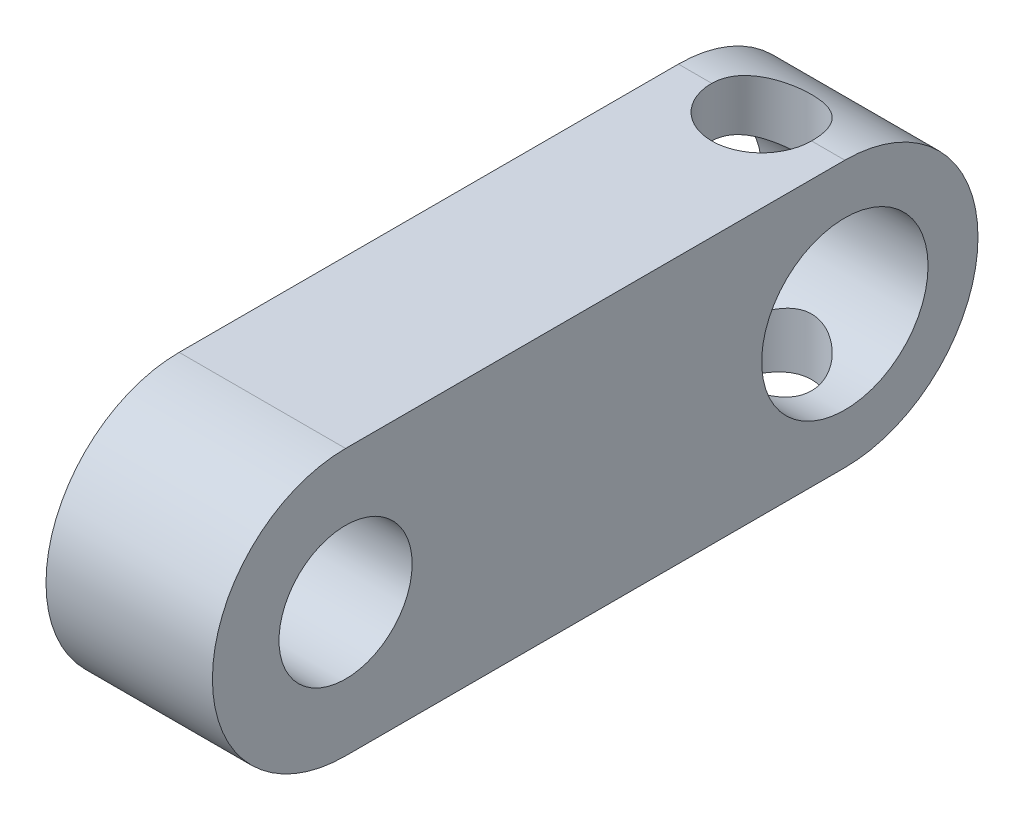
ISO-10303-21;
HEADER;
FILE_DESCRIPTION(('STEP AP214'),'2;1');
FILE_NAME('part.step','',(''),(''),'','','');
FILE_SCHEMA(('AUTOMOTIVE_DESIGN { 1 0 10303 214 1 1 1 1 }'));
ENDSEC;
DATA;
#1=APPLICATION_CONTEXT('core data for automotive mechanical design processes');
#2=APPLICATION_PROTOCOL_DEFINITION('international standard','automotive_design',2000,#1);
#3=PRODUCT_CONTEXT('',#1,'mechanical');
#4=PRODUCT('Part','Part','',(#3));
#5=PRODUCT_RELATED_PRODUCT_CATEGORY('part','',(#4));
#6=PRODUCT_DEFINITION_FORMATION('','',#4);
#7=PRODUCT_DEFINITION_CONTEXT('part definition',#1,'design');
#8=PRODUCT_DEFINITION('design','',#6,#7);
#9=PRODUCT_DEFINITION_SHAPE('','',#8);
#10=(LENGTH_UNIT() NAMED_UNIT(*) SI_UNIT(.MILLI.,.METRE.));
#11=(NAMED_UNIT(*) PLANE_ANGLE_UNIT() SI_UNIT($,.RADIAN.));
#12=(NAMED_UNIT(*) SI_UNIT($,.STERADIAN.) SOLID_ANGLE_UNIT());
#13=UNCERTAINTY_MEASURE_WITH_UNIT(LENGTH_MEASURE(1.E-05),#10,'distance_accuracy_value','');
#14=(GEOMETRIC_REPRESENTATION_CONTEXT(3) GLOBAL_UNCERTAINTY_ASSIGNED_CONTEXT((#13)) GLOBAL_UNIT_ASSIGNED_CONTEXT((#10,
#11,#12)) REPRESENTATION_CONTEXT('',''));
#15=CARTESIAN_POINT('',(0.,0.,0.));
#16=DIRECTION('',(0.,0.,1.));
#17=DIRECTION('',(1.,0.,0.));
#18=AXIS2_PLACEMENT_3D('',#15,#16,#17);
#19=CARTESIAN_POINT('',(10.,0.,15.));
#20=DIRECTION('',(1.,0.,0.));
#21=DIRECTION('',(0.,0.,-1.));
#22=AXIS2_PLACEMENT_3D('',#19,#20,#21);
#23=PLANE('',#22);
#24=CARTESIAN_POINT('',(10.,0.,-15.));
#25=DIRECTION('',(1.,0.,0.));
#26=DIRECTION('',(0.,0.,-1.));
#27=AXIS2_PLACEMENT_3D('',#24,#25,#26);
#28=CIRCLE('',#27,5.);
#29=CARTESIAN_POINT('',(10.,0.,-20.));
#30=VERTEX_POINT('',#29);
#31=EDGE_CURVE('E160',#30,#30,#28,.T.);
#32=ORIENTED_EDGE('',*,*,#31,.F.);
#33=EDGE_LOOP('',(#32));
#34=FACE_BOUND('',#33,.T.);
#35=CARTESIAN_POINT('',(10.,0.,15.));
#36=DIRECTION('',(1.,0.,0.));
#37=DIRECTION('',(0.,0.,-1.));
#38=AXIS2_PLACEMENT_3D('',#35,#36,#37);
#39=CIRCLE('',#38,8.);
#40=CARTESIAN_POINT('',(10.,8.,15.));
#41=VERTEX_POINT('',#40);
#42=CARTESIAN_POINT('',(10.,-8.,15.));
#43=VERTEX_POINT('',#42);
#44=EDGE_CURVE('E164',#41,#43,#39,.T.);
#45=ORIENTED_EDGE('',*,*,#44,.T.);
#46=DIRECTION('',(0.,0.,-1.));
#47=VECTOR('',#46,1.);
#48=CARTESIAN_POINT('',(10.,-8.,15.));
#49=LINE('',#48,#47);
#50=CARTESIAN_POINT('',(10.,-8.,-15.));
#51=VERTEX_POINT('',#50);
#52=EDGE_CURVE('E179',#43,#51,#49,.T.);
#53=ORIENTED_EDGE('',*,*,#52,.T.);
#54=CARTESIAN_POINT('',(10.,0.,-15.));
#55=DIRECTION('',(1.,0.,0.));
#56=DIRECTION('',(0.,0.,1.));
#57=AXIS2_PLACEMENT_3D('',#54,#55,#56);
#58=CIRCLE('',#57,8.);
#59=CARTESIAN_POINT('',(10.,8.,-15.));
#60=VERTEX_POINT('',#59);
#61=EDGE_CURVE('E109',#51,#60,#58,.T.);
#62=ORIENTED_EDGE('',*,*,#61,.T.);
#63=DIRECTION('',(0.,0.,1.));
#64=VECTOR('',#63,1.);
#65=CARTESIAN_POINT('',(10.,8.,-15.));
#66=LINE('',#65,#64);
#67=EDGE_CURVE('E183',#60,#41,#66,.T.);
#68=ORIENTED_EDGE('',*,*,#67,.T.);
#69=EDGE_LOOP('',(#45,#53,#62,#68));
#70=FACE_BOUND('',#69,.T.);
#71=CARTESIAN_POINT('',(10.,0.,15.));
#72=DIRECTION('',(1.,0.,0.));
#73=DIRECTION('',(0.,0.,-1.));
#74=AXIS2_PLACEMENT_3D('',#71,#72,#73);
#75=CIRCLE('',#74,4.);
#76=CARTESIAN_POINT('',(10.,0.,11.));
#77=VERTEX_POINT('',#76);
#78=EDGE_CURVE('E168',#77,#77,#75,.T.);
#79=ORIENTED_EDGE('',*,*,#78,.F.);
#80=EDGE_LOOP('',(#79));
#81=FACE_BOUND('',#80,.T.);
#82=ADVANCED_FACE('F35',(#34,#70,#81),#23,.T.);
#83=CARTESIAN_POINT('',(0.,0.,15.));
#84=DIRECTION('',(1.,0.,0.));
#85=DIRECTION('',(0.,0.,-1.));
#86=AXIS2_PLACEMENT_3D('',#83,#84,#85);
#87=PLANE('',#86);
#88=CARTESIAN_POINT('',(0.,0.,-15.));
#89=DIRECTION('',(1.,0.,0.));
#90=DIRECTION('',(0.,0.,-1.));
#91=AXIS2_PLACEMENT_3D('',#88,#89,#90);
#92=CIRCLE('',#91,5.);
#93=CARTESIAN_POINT('',(0.,0.,-20.));
#94=VERTEX_POINT('',#93);
#95=EDGE_CURVE('E170',#94,#94,#92,.T.);
#96=ORIENTED_EDGE('',*,*,#95,.T.);
#97=EDGE_LOOP('',(#96));
#98=FACE_BOUND('',#97,.T.);
#99=CARTESIAN_POINT('',(0.,0.,15.));
#100=DIRECTION('',(1.,0.,0.));
#101=DIRECTION('',(0.,0.,-1.));
#102=AXIS2_PLACEMENT_3D('',#99,#100,#101);
#103=CIRCLE('',#102,8.);
#104=CARTESIAN_POINT('',(0.,8.,15.));
#105=VERTEX_POINT('',#104);
#106=CARTESIAN_POINT('',(0.,-8.,15.));
#107=VERTEX_POINT('',#106);
#108=EDGE_CURVE('E176',#105,#107,#103,.T.);
#109=ORIENTED_EDGE('',*,*,#108,.F.);
#110=DIRECTION('',(0.,0.,1.));
#111=VECTOR('',#110,1.);
#112=CARTESIAN_POINT('',(0.,8.,-15.));
#113=LINE('',#112,#111);
#114=CARTESIAN_POINT('',(0.,8.,-15.));
#115=VERTEX_POINT('',#114);
#116=EDGE_CURVE('E180',#115,#105,#113,.T.);
#117=ORIENTED_EDGE('',*,*,#116,.F.);
#118=CARTESIAN_POINT('',(0.,0.,-15.));
#119=DIRECTION('',(1.,0.,0.));
#120=DIRECTION('',(0.,0.,1.));
#121=AXIS2_PLACEMENT_3D('',#118,#119,#120);
#122=CIRCLE('',#121,8.);
#123=CARTESIAN_POINT('',(0.,-8.,-15.));
#124=VERTEX_POINT('',#123);
#125=EDGE_CURVE('E190',#124,#115,#122,.T.);
#126=ORIENTED_EDGE('',*,*,#125,.F.);
#127=DIRECTION('',(0.,0.,-1.));
#128=VECTOR('',#127,1.);
#129=CARTESIAN_POINT('',(0.,-8.,15.));
#130=LINE('',#129,#128);
#131=EDGE_CURVE('E188',#107,#124,#130,.T.);
#132=ORIENTED_EDGE('',*,*,#131,.F.);
#133=EDGE_LOOP('',(#109,#117,#126,#132));
#134=FACE_BOUND('',#133,.T.);
#135=CARTESIAN_POINT('',(0.,0.,15.));
#136=DIRECTION('',(1.,0.,0.));
#137=DIRECTION('',(0.,0.,-1.));
#138=AXIS2_PLACEMENT_3D('',#135,#136,#137);
#139=CIRCLE('',#138,4.);
#140=CARTESIAN_POINT('',(0.,0.,11.));
#141=VERTEX_POINT('',#140);
#142=EDGE_CURVE('E96',#141,#141,#139,.T.);
#143=ORIENTED_EDGE('',*,*,#142,.T.);
#144=EDGE_LOOP('',(#143));
#145=FACE_BOUND('',#144,.T.);
#146=ADVANCED_FACE('F149',(#98,#134,#145),#87,.F.);
#147=CARTESIAN_POINT('',(10.,0.,15.));
#148=DIRECTION('',(-1.,0.,0.));
#149=DIRECTION('',(0.,0.,1.));
#150=AXIS2_PLACEMENT_3D('',#147,#148,#149);
#151=CYLINDRICAL_SURFACE('',#150,8.);
#152=ORIENTED_EDGE('',*,*,#108,.T.);
#153=DIRECTION('',(-1.,0.,0.));
#154=VECTOR('',#153,1.);
#155=CARTESIAN_POINT('',(10.,-8.,15.));
#156=LINE('',#155,#154);
#157=EDGE_CURVE('E11',#43,#107,#156,.T.);
#158=ORIENTED_EDGE('',*,*,#157,.F.);
#159=ORIENTED_EDGE('',*,*,#44,.F.);
#160=DIRECTION('',(-1.,0.,0.));
#161=VECTOR('',#160,1.);
#162=CARTESIAN_POINT('',(10.,8.,15.));
#163=LINE('',#162,#161);
#164=EDGE_CURVE('E185',#41,#105,#163,.T.);
#165=ORIENTED_EDGE('',*,*,#164,.T.);
#166=EDGE_LOOP('',(#152,#158,#159,#165));
#167=FACE_BOUND('',#166,.T.);
#168=ADVANCED_FACE('F37',(#167),#151,.T.);
#169=CARTESIAN_POINT('',(10.,-8.,15.));
#170=DIRECTION('',(0.,1.,0.));
#171=DIRECTION('',(0.,0.,1.));
#172=AXIS2_PLACEMENT_3D('',#169,#170,#171);
#173=PLANE('',#172);
#174=DIRECTION('',(-1.,0.,0.));
#175=VECTOR('',#174,1.);
#176=CARTESIAN_POINT('',(10.,-8.,-15.));
#177=LINE('',#176,#175);
#178=CARTESIAN_POINT('',(2.,-8.,-15.));
#179=VERTEX_POINT('',#178);
#180=EDGE_CURVE('E103',#179,#124,#177,.T.);
#181=ORIENTED_EDGE('',*,*,#180,.F.);
#182=CARTESIAN_POINT('',(5.,-8.,-15.));
#183=DIRECTION('',(0.,1.,0.));
#184=DIRECTION('',(0.,0.,1.));
#185=AXIS2_PLACEMENT_3D('',#182,#183,#184);
#186=CIRCLE('',#185,3.);
#187=CARTESIAN_POINT('',(8.,-8.,-15.));
#188=VERTEX_POINT('',#187);
#189=EDGE_CURVE('E55',#179,#188,#186,.T.);
#190=ORIENTED_EDGE('',*,*,#189,.T.);
#191=EDGE_CURVE('E48',#51,#188,#177,.T.);
#192=ORIENTED_EDGE('',*,*,#191,.F.);
#193=ORIENTED_EDGE('',*,*,#52,.F.);
#194=ORIENTED_EDGE('',*,*,#157,.T.);
#195=ORIENTED_EDGE('',*,*,#131,.T.);
#196=EDGE_LOOP('',(#181,#190,#192,#193,#194,#195));
#197=FACE_BOUND('',#196,.T.);
#198=ADVANCED_FACE('F100',(#197),#173,.F.);
#199=CARTESIAN_POINT('',(10.,0.,-15.));
#200=DIRECTION('',(-1.,0.,0.));
#201=DIRECTION('',(0.,0.,1.));
#202=AXIS2_PLACEMENT_3D('',#199,#200,#201);
#203=CYLINDRICAL_SURFACE('',#202,8.);
#204=ORIENTED_EDGE('',*,*,#191,.T.);
#205=CARTESIAN_POINT('',(8.,-8.,-15.));
#206=CARTESIAN_POINT('',(8.00001103003993,-8.00001151251917,-15.0813659418454));
#207=CARTESIAN_POINT('',(7.99669003614445,-7.99875895185085,-15.1627247162868));
#208=CARTESIAN_POINT('',(7.9834696649154,-7.99381151281105,-15.3248098564286));
#209=CARTESIAN_POINT('',(7.97357206793986,-7.99011729542405,-15.4055363873017));
#210=CARTESIAN_POINT('',(7.94732554873685,-7.98038766186784,-15.5655307975301));
#211=CARTESIAN_POINT('',(7.93099708377701,-7.97435967070118,-15.6448024760788));
#212=CARTESIAN_POINT('',(7.89206134761697,-7.96013151966453,-15.8015690201844));
#213=CARTESIAN_POINT('',(7.86945385815921,-7.95193128428827,-15.8790638238761));
#214=CARTESIAN_POINT('',(7.79252455835016,-7.92438404820679,-16.1079958005286));
#215=CARTESIAN_POINT('',(7.72905623759329,-7.90207507148888,-16.2561192480531));
#216=CARTESIAN_POINT('',(7.5798134067169,-7.85178467556054,-16.5395744370144));
#217=CARTESIAN_POINT('',(7.49402466260416,-7.82379963918051,-16.6748979404166));
#218=CARTESIAN_POINT('',(7.29877763022069,-7.76372558112298,-16.9346839961627));
#219=CARTESIAN_POINT('',(7.18854238032334,-7.73152085735817,-17.0585367000131));
#220=CARTESIAN_POINT('',(6.94918161687568,-7.66720506105773,-17.2864880565605));
#221=CARTESIAN_POINT('',(6.8200499199968,-7.63509402269942,-17.3905802174668));
#222=CARTESIAN_POINT('',(6.54056256150986,-7.57324885518661,-17.5799652623967));
#223=CARTESIAN_POINT('',(6.38958572937022,-7.54365189318829,-17.6643908248288));
#224=CARTESIAN_POINT('',(6.0742972030408,-7.49199638303748,-17.8063752020465));
#225=CARTESIAN_POINT('',(5.9099913601437,-7.46993454896922,-17.8639457317812));
#226=CARTESIAN_POINT('',(5.57976811518296,-7.43708841602121,-17.9481681764943));
#227=CARTESIAN_POINT('',(5.41419317445154,-7.42587870534969,-17.9759913072979));
#228=CARTESIAN_POINT('',(5.08037098288525,-7.41476122924514,-18.0035911458453));
#229=CARTESIAN_POINT('',(4.91212480958814,-7.41484901683932,-18.0033788890054));
#230=CARTESIAN_POINT('',(4.58845983579158,-7.42595027101939,-17.9758084846518));
#231=CARTESIAN_POINT('',(4.43287597491728,-7.43630952678155,-17.9500757652864));
#232=CARTESIAN_POINT('',(4.12842359873992,-7.46569902811917,-17.8748826968723));
#233=CARTESIAN_POINT('',(3.97955600297058,-7.48473045707913,-17.8254191095161));
#234=CARTESIAN_POINT('',(3.68944607498966,-7.52971401264463,-17.7032749271152));
#235=CARTESIAN_POINT('',(3.54840136882227,-7.55579029731672,-17.6301726655972));
#236=CARTESIAN_POINT('',(3.28010907198272,-7.61188407963322,-17.4631223376586));
#237=CARTESIAN_POINT('',(3.15286631345944,-7.64190294952165,-17.369167005291));
#238=CARTESIAN_POINT('',(2.9068006702968,-7.70495869393669,-17.1556407937871));
#239=CARTESIAN_POINT('',(2.78911653249784,-7.73806288463494,-17.0347736910856));
#240=CARTESIAN_POINT('',(2.57533896161741,-7.80183006456215,-16.7746524008373));
#241=CARTESIAN_POINT('',(2.47925174382808,-7.83249234940967,-16.6353929384849));
#242=CARTESIAN_POINT('',(2.31008615572179,-7.88854441274737,-16.3393348511528));
#243=CARTESIAN_POINT('',(2.23739890296607,-7.91384237052322,-16.1822920644346));
#244=CARTESIAN_POINT('',(2.1493020404674,-7.94517154509492,-15.9386214715073));
#245=CARTESIAN_POINT('',(2.12342748982051,-7.95451083382182,-15.8560584895259));
#246=CARTESIAN_POINT('',(2.0788624928564,-7.9707345786836,-15.6887905536117));
#247=CARTESIAN_POINT('',(2.06016894580771,-7.97762009425579,-15.6040865410457));
#248=CARTESIAN_POINT('',(2.03016506570909,-7.98872426130019,-15.4331443421316));
#249=CARTESIAN_POINT('',(2.01886042745939,-7.99294085569516,-15.3469050249479));
#250=CARTESIAN_POINT('',(2.00377499307039,-7.99858462583634,-15.1737797585207));
#251=CARTESIAN_POINT('',(1.99998571103467,-8.00001494764447,-15.0868946499097));
#252=CARTESIAN_POINT('',(2.,-8.,-15.));
#253=B_SPLINE_CURVE_WITH_KNOTS('',3,(#205,#206,#207,#208,#209,#210,#211,#212,#213,#214,#215,
#216,#217,#218,#219,#220,#221,#222,#223,#224,#225,#226,#227,#228,#229,#230,#231,#232,#233,#234,
#235,#236,#237,#238,#239,#240,#241,#242,#243,#244,#245,#246,#247,#248,#249,#250,#251,#252),
.UNSPECIFIED.,.F.,.F.,(4,2,2,2,2,2,2,2,2,2,2,2,2,2,2,2,2,2,2,2,2,2,2,4),(0.,0.244008331209201,
0.487950633604437,0.731123117692591,0.974304055462392,1.45994765998806,1.94590172742673,
2.45036167659436,2.95498706668727,3.47883807854963,4.00246035711349,4.50460755265715,
5.00655709133605,5.47846520353066,5.95043773049699,6.43134234339369,6.91241478425466,
7.42578367870283,7.93930012492457,8.46100088774236,8.72178131997561,8.98244902124609,
9.2433173888902,9.50389103130102),.UNSPECIFIED.);
#254=EDGE_CURVE('E91',#188,#179,#253,.T.);
#255=ORIENTED_EDGE('',*,*,#254,.T.);
#256=ORIENTED_EDGE('',*,*,#180,.T.);
#257=ORIENTED_EDGE('',*,*,#125,.T.);
#258=DIRECTION('',(-1.,0.,0.));
#259=VECTOR('',#258,1.);
#260=CARTESIAN_POINT('',(10.,8.,-15.));
#261=LINE('',#260,#259);
#262=CARTESIAN_POINT('',(2.,8.,-15.));
#263=VERTEX_POINT('',#262);
#264=EDGE_CURVE('E194',#263,#115,#261,.T.);
#265=ORIENTED_EDGE('',*,*,#264,.F.);
#266=CARTESIAN_POINT('',(2.,8.,-15.));
#267=CARTESIAN_POINT('',(1.99998896996008,8.00001151251917,-15.0813659418454));
#268=CARTESIAN_POINT('',(2.00330996385556,7.99875895185086,-15.1627247162868));
#269=CARTESIAN_POINT('',(2.01653033508461,7.99381151281106,-15.3248098564286));
#270=CARTESIAN_POINT('',(2.02642793206014,7.99011729542406,-15.4055363873017));
#271=CARTESIAN_POINT('',(2.05267445126316,7.98038766186785,-15.5655307975301));
#272=CARTESIAN_POINT('',(2.06900291622299,7.97435967070118,-15.6448024760788));
#273=CARTESIAN_POINT('',(2.10793865238304,7.96013151966454,-15.8015690201844));
#274=CARTESIAN_POINT('',(2.13054614184079,7.95193128428828,-15.8790638238761));
#275=CARTESIAN_POINT('',(2.20747544164984,7.9243840482068,-16.1079958005286));
#276=CARTESIAN_POINT('',(2.27094376240671,7.90207507148889,-16.2561192480531));
#277=CARTESIAN_POINT('',(2.42018659328311,7.85178467556055,-16.5395744370144));
#278=CARTESIAN_POINT('',(2.50597533739584,7.82379963918052,-16.6748979404165));
#279=CARTESIAN_POINT('',(2.70122236977931,7.76372558112299,-16.9346839961627));
#280=CARTESIAN_POINT('',(2.81145761967667,7.73152085735818,-17.058536700013));
#281=CARTESIAN_POINT('',(3.05081838312433,7.66720506105774,-17.2864880565605));
#282=CARTESIAN_POINT('',(3.1799500800032,7.63509402269943,-17.3905802174668));
#283=CARTESIAN_POINT('',(3.45943743849014,7.57324885518662,-17.5799652623967));
#284=CARTESIAN_POINT('',(3.61041427062978,7.5436518931883,-17.6643908248288));
#285=CARTESIAN_POINT('',(3.92570279695921,7.49199638303749,-17.8063752020465));
#286=CARTESIAN_POINT('',(4.09000863985631,7.46993454896923,-17.8639457317812));
#287=CARTESIAN_POINT('',(4.42023188481704,7.43708841602122,-17.9481681764943));
#288=CARTESIAN_POINT('',(4.58580682554846,7.4258787053497,-17.9759913072979));
#289=CARTESIAN_POINT('',(4.91962901711475,7.41476122924515,-18.0035911458453));
#290=CARTESIAN_POINT('',(5.08787519041186,7.41484901683933,-18.0033788890054));
#291=CARTESIAN_POINT('',(5.41154016420842,7.4259502710194,-17.9758084846518));
#292=CARTESIAN_POINT('',(5.56712402508272,7.43630952678156,-17.9500757652864));
#293=CARTESIAN_POINT('',(5.87157640126009,7.46569902811918,-17.8748826968723));
#294=CARTESIAN_POINT('',(6.02044399702942,7.48473045707914,-17.8254191095161));
#295=CARTESIAN_POINT('',(6.31055392501034,7.52971401264463,-17.7032749271152));
#296=CARTESIAN_POINT('',(6.45159863117773,7.55579029731672,-17.6301726655972));
#297=CARTESIAN_POINT('',(6.71989092801728,7.61188407963322,-17.4631223376586));
#298=CARTESIAN_POINT('',(6.84713368654056,7.64190294952165,-17.369167005291));
#299=CARTESIAN_POINT('',(7.09319932970321,7.7049586939367,-17.1556407937871));
#300=CARTESIAN_POINT('',(7.21088346750216,7.73806288463494,-17.0347736910856));
#301=CARTESIAN_POINT('',(7.42466103838259,7.80183006456216,-16.7746524008373));
#302=CARTESIAN_POINT('',(7.52074825617192,7.83249234940968,-16.6353929384849));
#303=CARTESIAN_POINT('',(7.68991384427821,7.88854441274738,-16.3393348511528));
#304=CARTESIAN_POINT('',(7.76260109703394,7.91384237052323,-16.1822920644346));
#305=CARTESIAN_POINT('',(7.85069795953261,7.94517154509493,-15.9386214715073));
#306=CARTESIAN_POINT('',(7.87657251017949,7.95451083382183,-15.8560584895259));
#307=CARTESIAN_POINT('',(7.92113750714361,7.9707345786836,-15.6887905536117));
#308=CARTESIAN_POINT('',(7.93983105419229,7.97762009425579,-15.6040865410457));
#309=CARTESIAN_POINT('',(7.96983493429092,7.9887242613002,-15.4331443421316));
#310=CARTESIAN_POINT('',(7.98113957254061,7.99294085569517,-15.3469050249479));
#311=CARTESIAN_POINT('',(7.99622500692961,7.99858462583635,-15.1737797585207));
#312=CARTESIAN_POINT('',(8.00001428896533,8.00001494764448,-15.0868946499097));
#313=CARTESIAN_POINT('',(8.,8.,-15.));
#314=B_SPLINE_CURVE_WITH_KNOTS('',3,(#266,#267,#268,#269,#270,#271,#272,#273,#274,#275,#276,
#277,#278,#279,#280,#281,#282,#283,#284,#285,#286,#287,#288,#289,#290,#291,#292,#293,#294,#295,
#296,#297,#298,#299,#300,#301,#302,#303,#304,#305,#306,#307,#308,#309,#310,#311,#312,#313),
.UNSPECIFIED.,.F.,.F.,(4,2,2,2,2,2,2,2,2,2,2,2,2,2,2,2,2,2,2,2,2,2,2,4),(0.,0.244008331209201,
0.487950633604439,0.731123117692592,0.97430405546239,1.45994765998806,1.94590172742672,
2.45036167659435,2.95498706668726,3.47883807854963,4.00246035711348,4.50460755265715,
5.00655709133604,5.47846520353066,5.95043773049699,6.43134234339369,6.91241478425465,
7.42578367870282,7.93930012492456,8.46100088774235,8.72178131997561,8.98244902124608,
9.2433173888902,9.50389103130102),.UNSPECIFIED.);
#315=CARTESIAN_POINT('',(8.,8.,-15.));
#316=VERTEX_POINT('',#315);
#317=EDGE_CURVE('E62',#263,#316,#314,.T.);
#318=ORIENTED_EDGE('',*,*,#317,.T.);
#319=EDGE_CURVE('E111',#60,#316,#261,.T.);
#320=ORIENTED_EDGE('',*,*,#319,.F.);
#321=ORIENTED_EDGE('',*,*,#61,.F.);
#322=EDGE_LOOP('',(#204,#255,#256,#257,#265,#318,#320,#321));
#323=FACE_BOUND('',#322,.T.);
#324=ADVANCED_FACE('F107',(#323),#203,.T.);
#325=CARTESIAN_POINT('',(10.,8.,-15.));
#326=DIRECTION('',(0.,-1.,0.));
#327=DIRECTION('',(0.,0.,-1.));
#328=AXIS2_PLACEMENT_3D('',#325,#326,#327);
#329=PLANE('',#328);
#330=ORIENTED_EDGE('',*,*,#319,.T.);
#331=CARTESIAN_POINT('',(5.,8.,-15.));
#332=DIRECTION('',(0.,1.,0.));
#333=DIRECTION('',(0.,0.,1.));
#334=AXIS2_PLACEMENT_3D('',#331,#332,#333);
#335=CIRCLE('',#334,3.);
#336=EDGE_CURVE('E105',#263,#316,#335,.T.);
#337=ORIENTED_EDGE('',*,*,#336,.F.);
#338=ORIENTED_EDGE('',*,*,#264,.T.);
#339=ORIENTED_EDGE('',*,*,#116,.T.);
#340=ORIENTED_EDGE('',*,*,#164,.F.);
#341=ORIENTED_EDGE('',*,*,#67,.F.);
#342=EDGE_LOOP('',(#330,#337,#338,#339,#340,#341));
#343=FACE_BOUND('',#342,.T.);
#344=ADVANCED_FACE('F142',(#343),#329,.F.);
#345=CARTESIAN_POINT('',(10.,0.,-15.));
#346=DIRECTION('',(-1.,0.,0.));
#347=DIRECTION('',(0.,0.,1.));
#348=AXIS2_PLACEMENT_3D('',#345,#346,#347);
#349=CYLINDRICAL_SURFACE('',#348,5.);
#350=CARTESIAN_POINT('',(5.,-3.99999999999999,-12.));
#351=CARTESIAN_POINT('',(5.07546161036567,-3.99999997094658,-12.0000000940076));
#352=CARTESIAN_POINT('',(5.15091995182571,-4.00214560778385,-12.002853399255));
#353=CARTESIAN_POINT('',(5.30118357915588,-4.01061905841258,-12.0142039797617));
#354=CARTESIAN_POINT('',(5.37598860368072,-4.01694847458097,-12.0227034174817));
#355=CARTESIAN_POINT('',(5.59854240080013,-4.04185988554313,-12.05649804123));
#356=CARTESIAN_POINT('',(5.74446616303865,-4.06636523363866,-12.0900896320742));
#357=CARTESIAN_POINT('',(6.02619529387303,-4.12724466313279,-12.1771311193567));
#358=CARTESIAN_POINT('',(6.16206540972156,-4.16353284212726,-12.2304376641876));
#359=CARTESIAN_POINT('',(6.42286717142597,-4.24371857831162,-12.354941060607));
#360=CARTESIAN_POINT('',(6.54779553947816,-4.28761840405593,-12.4261432486164));
#361=CARTESIAN_POINT('',(6.79990131024536,-4.3845721143975,-12.5945765806894));
#362=CARTESIAN_POINT('',(6.92548608074574,-4.43808896832273,-12.6939258001606));
#363=CARTESIAN_POINT('',(7.15952535636892,-4.54452303763807,-12.911454578408));
#364=CARTESIAN_POINT('',(7.26796690142325,-4.59743977155758,-13.0296482490647));
#365=CARTESIAN_POINT('',(7.47628246871424,-4.70351798165428,-13.2971542195773));
#366=CARTESIAN_POINT('',(7.57396641364106,-4.75608869625048,-13.4484487069009));
#367=CARTESIAN_POINT('',(7.69974650858798,-4.82570563669468,-13.6886756956084));
#368=CARTESIAN_POINT('',(7.73822411545812,-4.84737661360986,-13.770992632174));
#369=CARTESIAN_POINT('',(7.80779096487915,-4.88701002756048,-13.9395277870037));
#370=CARTESIAN_POINT('',(7.83888509171157,-4.90497491519086,-14.0257433810532));
#371=CARTESIAN_POINT('',(7.8906274624533,-4.93511193886539,-14.1930319733286));
#372=CARTESIAN_POINT('',(7.9119872715291,-4.94767216447125,-14.2738158412598));
#373=CARTESIAN_POINT('',(7.94794996135096,-4.96892323787741,-14.4373336512556));
#374=CARTESIAN_POINT('',(7.9625566076376,-4.97761624192486,-14.5200664794724));
#375=CARTESIAN_POINT('',(7.9847846845161,-4.99087754875312,-14.6867553787326));
#376=CARTESIAN_POINT('',(7.9924098423118,-4.99544805239181,-14.7707107727346));
#377=CARTESIAN_POINT('',(8.00056663984718,-5.00033941607428,-14.9390602111148));
#378=CARTESIAN_POINT('',(8.00109900129356,-5.00066070848407,-15.0234542099898));
#379=CARTESIAN_POINT('',(7.99275721772026,-4.99565270087357,-15.2551711836464));
#380=CARTESIAN_POINT('',(7.97652885035085,-4.98590479614142,-15.4022199572672));
#381=CARTESIAN_POINT('',(7.92304450631758,-4.95416390550291,-15.6909562488184));
#382=CARTESIAN_POINT('',(7.8857869733895,-4.93217001333339,-15.8326433691314));
#383=CARTESIAN_POINT('',(7.79166776699805,-4.87769707511974,-16.1081060706919));
#384=CARTESIAN_POINT('',(7.73469357980008,-4.84515792140774,-16.2418309672266));
#385=CARTESIAN_POINT('',(7.60323106554831,-4.77219304045845,-16.4979793356035));
#386=CARTESIAN_POINT('',(7.52873818986414,-4.73176526544935,-16.6203998608124));
#387=CARTESIAN_POINT('',(7.35432172038149,-4.64075842839173,-16.8661478979925));
#388=CARTESIAN_POINT('',(7.2524233514645,-4.58954363323803,-16.9878371548076));
#389=CARTESIAN_POINT('',(7.03119178989514,-4.48511110796774,-17.2134294892317));
#390=CARTESIAN_POINT('',(6.91183500028095,-4.4318907405416,-17.3173080743411));
#391=CARTESIAN_POINT('',(6.64269317960225,-4.32222149525339,-17.5164967015933));
#392=CARTESIAN_POINT('',(6.4909848446704,-4.26611322583746,-17.6094186492759));
#393=CARTESIAN_POINT('',(6.17058753897334,-4.16501759300692,-17.7679443583545));
#394=CARTESIAN_POINT('',(6.00193056868576,-4.12000980621702,-17.8335984435137));
#395=CARTESIAN_POINT('',(5.69521273550437,-4.05791730375361,-17.9215499380844));
#396=CARTESIAN_POINT('',(5.55991873420767,-4.03667777278559,-17.9505580631848));
#397=CARTESIAN_POINT('',(5.28525278059874,-4.00784301513237,-17.9896174581706));
#398=CARTESIAN_POINT('',(5.1458857631155,-4.00023192044755,-17.9996907751055));
#399=CARTESIAN_POINT('',(4.86689663103837,-3.99977828828379,-18.0002956132238));
#400=CARTESIAN_POINT('',(4.72727443039828,-4.00695621149423,-17.9908000607619));
#401=CARTESIAN_POINT('',(4.45202532768623,-4.03503040875294,-17.9528058447163));
#402=CARTESIAN_POINT('',(4.31640167218009,-4.05593752603304,-17.9242921604511));
#403=CARTESIAN_POINT('',(4.05257078445052,-4.1086353928605,-17.8497661286793));
#404=CARTESIAN_POINT('',(3.92435451586245,-4.14041253958232,-17.8037756438149));
#405=CARTESIAN_POINT('',(3.67704477969248,-4.21143069058873,-17.695925682648));
#406=CARTESIAN_POINT('',(3.5579547754061,-4.25067450889245,-17.6340602203517));
#407=CARTESIAN_POINT('',(3.3095189047537,-4.34073681424694,-17.4833467580386));
#408=CARTESIAN_POINT('',(3.18219456767056,-4.39236652981539,-17.391645038527));
#409=CARTESIAN_POINT('',(2.94343279605459,-4.49643335252963,-17.1897561409589));
#410=CARTESIAN_POINT('',(2.83201075390556,-4.54887118822612,-17.0795512745713));
#411=CARTESIAN_POINT('',(2.61353600868425,-4.65671991538654,-16.8265147552832));
#412=CARTESIAN_POINT('',(2.50893529423711,-4.71163080343121,-16.6813039702003));
#413=CARTESIAN_POINT('',(2.37184550227661,-4.78599458202111,-16.4494463127851));
#414=CARTESIAN_POINT('',(2.32943799786309,-4.80945640676866,-16.3697860571165));
#415=CARTESIAN_POINT('',(2.25169611652151,-4.85305400686526,-16.2062365616233));
#416=CARTESIAN_POINT('',(2.2163572868813,-4.87319187464059,-16.1223500259857));
#417=CARTESIAN_POINT('',(2.15552035676558,-4.9082066725368,-15.9571406987749));
#418=CARTESIAN_POINT('',(2.12949628153821,-4.9233583127873,-15.876069467338));
#419=CARTESIAN_POINT('',(2.08433501839092,-4.94982497459131,-15.7114606199813));
#420=CARTESIAN_POINT('',(2.06519397112009,-4.96114214594588,-15.6279244147088));
#421=CARTESIAN_POINT('',(2.03409969028691,-4.9795990393125,-15.4591196150823));
#422=CARTESIAN_POINT('',(2.02214156263945,-4.98674160560362,-15.3738522413041));
#423=CARTESIAN_POINT('',(2.00559323834099,-4.99664216975594,-15.2023841591635));
#424=CARTESIAN_POINT('',(2.00100208121105,-4.99940073918632,-15.1161835739454));
#425=CARTESIAN_POINT('',(1.9986717102406,-5.00079353601933,-14.8804806159194));
#426=CARTESIAN_POINT('',(2.0083989254259,-4.9949361975757,-14.7307868650284));
#427=CARTESIAN_POINT('',(2.04978205414895,-4.97026391444784,-14.4356744555224));
#428=CARTESIAN_POINT('',(2.08143821194009,-4.95144882543496,-14.2902558445445));
#429=CARTESIAN_POINT('',(2.16444057064628,-4.90298726022976,-14.0097163825697));
#430=CARTESIAN_POINT('',(2.215463439549,-4.87351900635896,-13.8744679435132));
#431=CARTESIAN_POINT('',(2.33528094176348,-4.8060670798365,-13.6144340468185));
#432=CARTESIAN_POINT('',(2.40407956034357,-4.76808149787884,-13.489650943797));
#433=CARTESIAN_POINT('',(2.56584990689575,-4.68186861678971,-13.2394734718799));
#434=CARTESIAN_POINT('',(2.66063506352805,-4.63297714592576,-13.115483365459));
#435=CARTESIAN_POINT('',(2.86750842456549,-4.5320378935883,-12.8842042221031));
#436=CARTESIAN_POINT('',(2.97961579766439,-4.47998665474642,-12.7769339546854));
#437=CARTESIAN_POINT('',(3.23456104337874,-4.37056449731607,-12.5681830014736));
#438=CARTESIAN_POINT('',(3.3794930844891,-4.31335603990193,-12.4691615882019));
#439=CARTESIAN_POINT('',(3.68700957259527,-4.20752457767502,-12.2968539393888));
#440=CARTESIAN_POINT('',(3.84958478419804,-4.15889711577766,-12.2235543239233));
#441=CARTESIAN_POINT('',(4.09662255268764,-4.10004730463764,-12.1380651508542));
#442=CARTESIAN_POINT('',(4.17565859129723,-4.0832950867822,-12.1142876338667));
#443=CARTESIAN_POINT('',(4.33613044180017,-4.05395087655968,-12.0732061825445));
#444=CARTESIAN_POINT('',(4.41756469998733,-4.04135625254712,-12.0558981522764));
#445=CARTESIAN_POINT('',(4.58204655069406,-4.0209497222627,-12.0280877872857));
#446=CARTESIAN_POINT('',(4.66509136837173,-4.01313023377048,-12.0175746616849));
#447=CARTESIAN_POINT('',(4.83209221666362,-4.00265571377826,-12.0035311551456));
#448=CARTESIAN_POINT('',(4.91604813126241,-4.00000003232224,-11.9999998954155));
#449=CARTESIAN_POINT('',(5.,-3.99999999999999,-12.));
#450=B_SPLINE_CURVE_WITH_KNOTS('',3,(#350,#351,#352,#353,#354,#355,#356,#357,#358,#359,#360,
#361,#362,#363,#364,#365,#366,#367,#368,#369,#370,#371,#372,#373,#374,#375,#376,#377,#378,#379,
#380,#381,#382,#383,#384,#385,#386,#387,#388,#389,#390,#391,#392,#393,#394,#395,#396,#397,#398,
#399,#400,#401,#402,#403,#404,#405,#406,#407,#408,#409,#410,#411,#412,#413,#414,#415,#416,#417,
#418,#419,#420,#421,#422,#423,#424,#425,#426,#427,#428,#429,#430,#431,#432,#433,#434,#435,#436,
#437,#438,#439,#440,#441,#442,#443,#444,#445,#446,#447,#448,#449),.UNSPECIFIED.,.T.,.F.,(4,2,2,
2,2,2,2,2,2,2,2,2,2,2,2,2,2,2,2,2,2,2,2,2,2,2,2,2,2,2,2,2,2,2,2,2,2,2,2,2,2,2,2,2,2,2,2,2,2,4),
(0.,0.22628817351788,0.452663065091107,0.905305714765857,1.35471981612576,1.80426809059901,
2.30878181396805,2.81367513819685,3.37309572088444,3.65297634398311,3.93267130287329,
4.18580566749444,4.43879871451846,4.69165661737851,4.94448879122709,5.38694235003539,
5.82942865693065,6.2744828398993,6.71965270654932,7.21799594026829,7.71701907227944,
8.27387316194679,8.82969494223663,9.24786570023495,9.6655492520208,10.0838110593649,
10.5024036052238,10.9204742264512,11.3387027222345,11.8323285087813,12.3264288987104,
12.884776299373,13.1641700331408,13.4433872125907,13.7024631857777,13.9613936663243,
14.2201475237758,14.4788676430947,14.9267946196281,15.3747265854331,15.8154875864153,
16.2563474905318,16.7450674536299,17.2343321574792,17.7856420979722,18.3366648323363,
18.5890061072372,18.8411873492279,19.0929671157917,19.3447151893882),.UNSPECIFIED.);
#451=CARTESIAN_POINT('',(5.,-3.99999999999999,-12.));
#452=VERTEX_POINT('',#451);
#453=EDGE_CURVE('E39',#452,#452,#450,.T.);
#454=ORIENTED_EDGE('',*,*,#453,.F.);
#455=EDGE_LOOP('',(#454));
#456=FACE_BOUND('',#455,.T.);
#457=CARTESIAN_POINT('',(5.,4.,-12.));
#458=CARTESIAN_POINT('',(4.92453838963434,3.99999997094658,-12.0000000940076));
#459=CARTESIAN_POINT('',(4.8490800481743,4.00214560778386,-12.002853399255));
#460=CARTESIAN_POINT('',(4.69881642084412,4.01061905841259,-12.0142039797617));
#461=CARTESIAN_POINT('',(4.62401139631928,4.01694847458097,-12.0227034174817));
#462=CARTESIAN_POINT('',(4.40145759919988,4.04185988554313,-12.05649804123));
#463=CARTESIAN_POINT('',(4.25553383696135,4.06636523363867,-12.0900896320742));
#464=CARTESIAN_POINT('',(3.97380470612698,4.1272446631328,-12.1771311193567));
#465=CARTESIAN_POINT('',(3.83793459027845,4.16353284212727,-12.2304376641876));
#466=CARTESIAN_POINT('',(3.57713282857404,4.24371857831163,-12.354941060607));
#467=CARTESIAN_POINT('',(3.45220446052185,4.28761840405594,-12.4261432486164));
#468=CARTESIAN_POINT('',(3.20009868975464,4.3845721143975,-12.5945765806894));
#469=CARTESIAN_POINT('',(3.07451391925426,4.43808896832273,-12.6939258001606));
#470=CARTESIAN_POINT('',(2.84047464363109,4.54452303763808,-12.911454578408));
#471=CARTESIAN_POINT('',(2.73203309857675,4.59743977155759,-13.0296482490647));
#472=CARTESIAN_POINT('',(2.52371753128576,4.70351798165429,-13.2971542195773));
#473=CARTESIAN_POINT('',(2.42603358635894,4.75608869625048,-13.4484487069009));
#474=CARTESIAN_POINT('',(2.30025349141203,4.82570563669468,-13.6886756956084));
#475=CARTESIAN_POINT('',(2.26177588454189,4.84737661360987,-13.770992632174));
#476=CARTESIAN_POINT('',(2.19220903512086,4.88701002756049,-13.9395277870037));
#477=CARTESIAN_POINT('',(2.16111490828843,4.90497491519086,-14.0257433810532));
#478=CARTESIAN_POINT('',(2.10937253754671,4.9351119388654,-14.1930319733286));
#479=CARTESIAN_POINT('',(2.0880127284709,4.94767216447126,-14.2738158412598));
#480=CARTESIAN_POINT('',(2.05205003864904,4.96892323787742,-14.4373336512556));
#481=CARTESIAN_POINT('',(2.0374433923624,4.97761624192487,-14.5200664794724));
#482=CARTESIAN_POINT('',(2.01521531548391,4.99087754875312,-14.6867553787326));
#483=CARTESIAN_POINT('',(2.0075901576882,4.99544805239181,-14.7707107727346));
#484=CARTESIAN_POINT('',(1.99943336015282,5.00033941607428,-14.9390602111148));
#485=CARTESIAN_POINT('',(1.99890099870644,5.00066070848408,-15.0234542099898));
#486=CARTESIAN_POINT('',(2.00724278227974,4.99565270087357,-15.2551711836464));
#487=CARTESIAN_POINT('',(2.02347114964915,4.98590479614143,-15.4022199572672));
#488=CARTESIAN_POINT('',(2.07695549368242,4.95416390550291,-15.6909562488184));
#489=CARTESIAN_POINT('',(2.1142130266105,4.9321700133334,-15.8326433691314));
#490=CARTESIAN_POINT('',(2.20833223300195,4.87769707511975,-16.1081060706919));
#491=CARTESIAN_POINT('',(2.26530642019992,4.84515792140775,-16.2418309672266));
#492=CARTESIAN_POINT('',(2.3967689344517,4.77219304045846,-16.4979793356035));
#493=CARTESIAN_POINT('',(2.47126181013586,4.73176526544935,-16.6203998608124));
#494=CARTESIAN_POINT('',(2.64567827961852,4.64075842839173,-16.8661478979925));
#495=CARTESIAN_POINT('',(2.74757664853551,4.58954363323804,-16.9878371548076));
#496=CARTESIAN_POINT('',(2.96880821010486,4.48511110796775,-17.2134294892317));
#497=CARTESIAN_POINT('',(3.08816499971906,4.43189074054161,-17.3173080743411));
#498=CARTESIAN_POINT('',(3.35730682039775,4.3222214952534,-17.5164967015933));
#499=CARTESIAN_POINT('',(3.5090151553296,4.26611322583747,-17.6094186492759));
#500=CARTESIAN_POINT('',(3.82941246102666,4.16501759300693,-17.7679443583545));
#501=CARTESIAN_POINT('',(3.99806943131425,4.12000980621703,-17.8335984435137));
#502=CARTESIAN_POINT('',(4.30478726449563,4.05791730375362,-17.9215499380844));
#503=CARTESIAN_POINT('',(4.44008126579234,4.03667777278559,-17.9505580631848));
#504=CARTESIAN_POINT('',(4.71474721940127,4.00784301513238,-17.9896174581706));
#505=CARTESIAN_POINT('',(4.85411423688451,4.00023192044756,-17.9996907751055));
#506=CARTESIAN_POINT('',(5.13310336896164,3.9997782882838,-18.0002956132238));
#507=CARTESIAN_POINT('',(5.27272556960172,4.00695621149423,-17.9908000607619));
#508=CARTESIAN_POINT('',(5.54797467231378,4.03503040875294,-17.9528058447163));
#509=CARTESIAN_POINT('',(5.68359832781991,4.05593752603305,-17.9242921604511));
#510=CARTESIAN_POINT('',(5.94742921554948,4.10863539286051,-17.8497661286793));
#511=CARTESIAN_POINT('',(6.07564548413756,4.14041253958233,-17.8037756438149));
#512=CARTESIAN_POINT('',(6.32295522030753,4.21143069058874,-17.695925682648));
#513=CARTESIAN_POINT('',(6.44204522459391,4.25067450889246,-17.6340602203517));
#514=CARTESIAN_POINT('',(6.69048109524631,4.34073681424694,-17.4833467580386));
#515=CARTESIAN_POINT('',(6.81780543232945,4.3923665298154,-17.391645038527));
#516=CARTESIAN_POINT('',(7.05656720394542,4.49643335252964,-17.1897561409589));
#517=CARTESIAN_POINT('',(7.16798924609445,4.54887118822613,-17.0795512745713));
#518=CARTESIAN_POINT('',(7.38646399131576,4.65671991538655,-16.8265147552832));
#519=CARTESIAN_POINT('',(7.4910647057629,4.71163080343122,-16.6813039702003));
#520=CARTESIAN_POINT('',(7.6281544977234,4.78599458202112,-16.4494463127851));
#521=CARTESIAN_POINT('',(7.67056200213692,4.80945640676867,-16.3697860571165));
#522=CARTESIAN_POINT('',(7.7483038834785,4.85305400686527,-16.2062365616232));
#523=CARTESIAN_POINT('',(7.78364271311871,4.87319187464059,-16.1223500259857));
#524=CARTESIAN_POINT('',(7.84447964323443,4.90820667253681,-15.9571406987749));
#525=CARTESIAN_POINT('',(7.87050371846179,4.92335831278731,-15.876069467338));
#526=CARTESIAN_POINT('',(7.91566498160909,4.94982497459132,-15.7114606199813));
#527=CARTESIAN_POINT('',(7.93480602887992,4.96114214594589,-15.6279244147088));
#528=CARTESIAN_POINT('',(7.9659003097131,4.97959903931251,-15.4591196150823));
#529=CARTESIAN_POINT('',(7.97785843736056,4.98674160560363,-15.373852241304));
#530=CARTESIAN_POINT('',(7.99440676165902,4.99664216975595,-15.2023841591635));
#531=CARTESIAN_POINT('',(7.99899791878896,4.99940073918633,-15.1161835739454));
#532=CARTESIAN_POINT('',(8.00132828975941,5.00079353601933,-14.8804806159194));
#533=CARTESIAN_POINT('',(7.9916010745741,4.99493619757571,-14.7307868650284));
#534=CARTESIAN_POINT('',(7.95021794585106,4.97026391444784,-14.4356744555224));
#535=CARTESIAN_POINT('',(7.91856178805992,4.95144882543497,-14.2902558445445));
#536=CARTESIAN_POINT('',(7.83555942935372,4.90298726022977,-14.0097163825697));
#537=CARTESIAN_POINT('',(7.784536560451,4.87351900635897,-13.8744679435132));
#538=CARTESIAN_POINT('',(7.66471905823652,4.8060670798365,-13.6144340468185));
#539=CARTESIAN_POINT('',(7.59592043965644,4.76808149787885,-13.489650943797));
#540=CARTESIAN_POINT('',(7.43415009310425,4.68186861678972,-13.2394734718799));
#541=CARTESIAN_POINT('',(7.33936493647195,4.63297714592576,-13.115483365459));
#542=CARTESIAN_POINT('',(7.13249157543451,4.5320378935883,-12.8842042221031));
#543=CARTESIAN_POINT('',(7.02038420233561,4.47998665474642,-12.7769339546854));
#544=CARTESIAN_POINT('',(6.76543895662126,4.37056449731608,-12.5681830014736));
#545=CARTESIAN_POINT('',(6.6205069155109,4.31335603990194,-12.4691615882019));
#546=CARTESIAN_POINT('',(6.31299042740473,4.20752457767503,-12.2968539393887));
#547=CARTESIAN_POINT('',(6.15041521580196,4.15889711577767,-12.2235543239233));
#548=CARTESIAN_POINT('',(5.90337744731237,4.10004730463765,-12.1380651508542));
#549=CARTESIAN_POINT('',(5.82434140870277,4.0832950867822,-12.1142876338667));
#550=CARTESIAN_POINT('',(5.66386955819984,4.05395087655969,-12.0732061825445));
#551=CARTESIAN_POINT('',(5.58243530001268,4.04135625254712,-12.0558981522764));
#552=CARTESIAN_POINT('',(5.41795344930595,4.0209497222627,-12.0280877872857));
#553=CARTESIAN_POINT('',(5.33490863162828,4.01313023377049,-12.0175746616849));
#554=CARTESIAN_POINT('',(5.16790778333639,4.00265571377826,-12.0035311551456));
#555=CARTESIAN_POINT('',(5.0839518687376,4.00000003232225,-11.9999998954155));
#556=CARTESIAN_POINT('',(5.,4.,-12.));
#557=B_SPLINE_CURVE_WITH_KNOTS('',3,(#457,#458,#459,#460,#461,#462,#463,#464,#465,#466,#467,
#468,#469,#470,#471,#472,#473,#474,#475,#476,#477,#478,#479,#480,#481,#482,#483,#484,#485,#486,
#487,#488,#489,#490,#491,#492,#493,#494,#495,#496,#497,#498,#499,#500,#501,#502,#503,#504,#505,
#506,#507,#508,#509,#510,#511,#512,#513,#514,#515,#516,#517,#518,#519,#520,#521,#522,#523,#524,
#525,#526,#527,#528,#529,#530,#531,#532,#533,#534,#535,#536,#537,#538,#539,#540,#541,#542,#543,
#544,#545,#546,#547,#548,#549,#550,#551,#552,#553,#554,#555,#556),.UNSPECIFIED.,.T.,.F.,(4,2,2,
2,2,2,2,2,2,2,2,2,2,2,2,2,2,2,2,2,2,2,2,2,2,2,2,2,2,2,2,2,2,2,2,2,2,2,2,2,2,2,2,2,2,2,2,2,2,4),
(0.,0.226288173517879,0.452663065091109,0.905305714765857,1.35471981612576,1.80426809059901,
2.30878181396805,2.81367513819685,3.37309572088444,3.65297634398311,3.93267130287329,
4.18580566749444,4.43879871451846,4.69165661737851,4.94448879122709,5.38694235003539,
5.82942865693065,6.27448283989929,6.71965270654932,7.2179959402683,7.71701907227944,
8.27387316194679,8.82969494223663,9.24786570023495,9.6655492520208,10.0838110593649,
10.5024036052238,10.9204742264512,11.3387027222345,11.8323285087813,12.3264288987104,
12.884776299373,13.1641700331408,13.4433872125907,13.7024631857777,13.9613936663243,
14.2201475237758,14.4788676430947,14.9267946196281,15.3747265854331,15.8154875864153,
16.2563474905319,16.7450674536299,17.2343321574793,17.7856420979722,18.3366648323363,
18.5890061072372,18.8411873492279,19.0929671157917,19.3447151893882),.UNSPECIFIED.);
#558=CARTESIAN_POINT('',(5.,4.,-12.));
#559=VERTEX_POINT('',#558);
#560=EDGE_CURVE('E104',#559,#559,#557,.T.);
#561=ORIENTED_EDGE('',*,*,#560,.F.);
#562=EDGE_LOOP('',(#561));
#563=FACE_BOUND('',#562,.T.);
#564=ORIENTED_EDGE('',*,*,#31,.T.);
#565=EDGE_LOOP('',(#564));
#566=FACE_BOUND('',#565,.T.);
#567=ORIENTED_EDGE('',*,*,#95,.F.);
#568=EDGE_LOOP('',(#567));
#569=FACE_BOUND('',#568,.T.);
#570=ADVANCED_FACE('F117',(#456,#563,#566,#569),#349,.F.);
#571=CARTESIAN_POINT('',(10.,0.,15.));
#572=DIRECTION('',(-1.,0.,0.));
#573=DIRECTION('',(0.,0.,1.));
#574=AXIS2_PLACEMENT_3D('',#571,#572,#573);
#575=CYLINDRICAL_SURFACE('',#574,4.);
#576=ORIENTED_EDGE('',*,*,#78,.T.);
#577=EDGE_LOOP('',(#576));
#578=FACE_BOUND('',#577,.T.);
#579=ORIENTED_EDGE('',*,*,#142,.F.);
#580=EDGE_LOOP('',(#579));
#581=FACE_BOUND('',#580,.T.);
#582=ADVANCED_FACE('F125',(#578,#581),#575,.F.);
#583=CARTESIAN_POINT('',(5.,-8.,-15.));
#584=DIRECTION('',(0.,1.,0.));
#585=DIRECTION('',(0.,0.,1.));
#586=AXIS2_PLACEMENT_3D('',#583,#584,#585);
#587=CYLINDRICAL_SURFACE('',#586,3.);
#588=ORIENTED_EDGE('',*,*,#560,.T.);
#589=EDGE_LOOP('',(#588));
#590=FACE_BOUND('',#589,.T.);
#591=ORIENTED_EDGE('',*,*,#336,.T.);
#592=ORIENTED_EDGE('',*,*,#317,.F.);
#593=EDGE_LOOP('',(#591,#592));
#594=FACE_BOUND('',#593,.T.);
#595=ADVANCED_FACE('F123',(#590,#594),#587,.F.);
#596=ORIENTED_EDGE('',*,*,#453,.T.);
#597=EDGE_LOOP('',(#596));
#598=FACE_BOUND('',#597,.T.);
#599=ORIENTED_EDGE('',*,*,#189,.F.);
#600=ORIENTED_EDGE('',*,*,#254,.F.);
#601=EDGE_LOOP('',(#599,#600));
#602=FACE_BOUND('',#601,.T.);
#603=ADVANCED_FACE('F92',(#598,#602),#587,.F.);
#604=CLOSED_SHELL('',(#82,#146,#168,#198,#324,#344,#570,#582,#595,#603));
#605=MANIFOLD_SOLID_BREP('B2',#604);
#606=ADVANCED_BREP_SHAPE_REPRESENTATION('',(#18,#605),#14);
#607=SHAPE_DEFINITION_REPRESENTATION(#9,#606);
ENDSEC;
END-ISO-10303-21;
